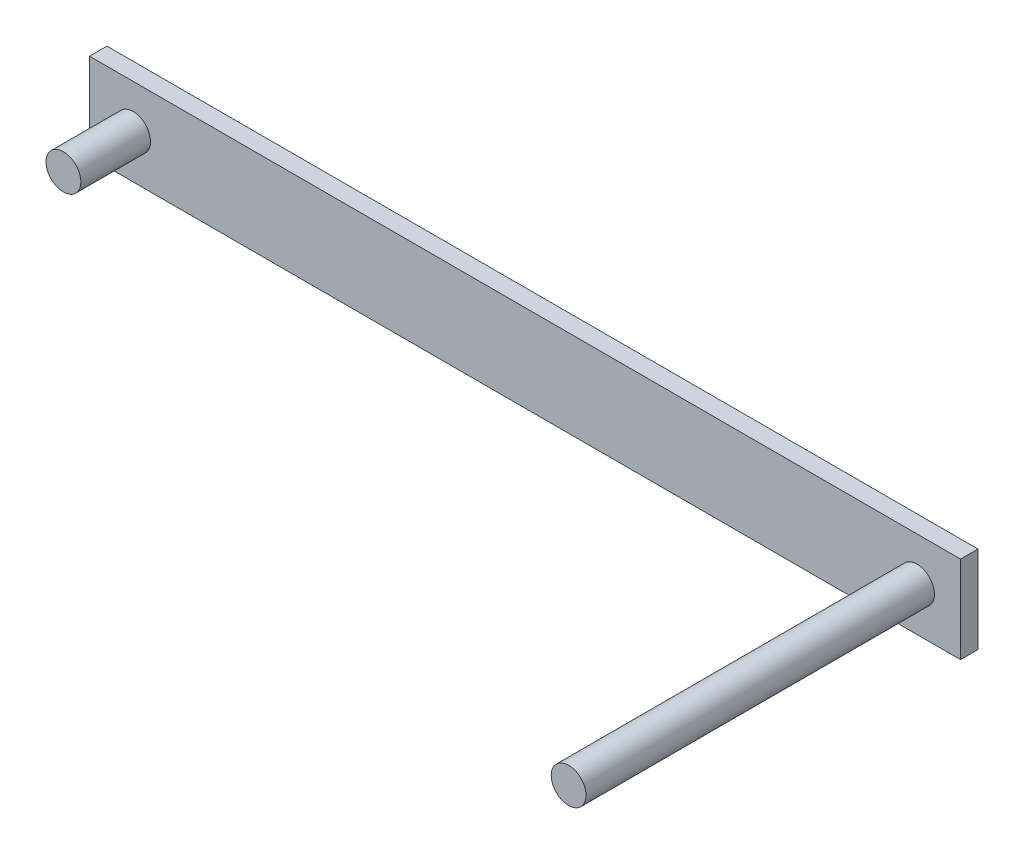
ISO-10303-21;
HEADER;
FILE_DESCRIPTION(('STEP AP214'),'2;1');
FILE_NAME('part.step','',(''),(''),'','','');
FILE_SCHEMA(('AUTOMOTIVE_DESIGN { 1 0 10303 214 1 1 1 1 }'));
ENDSEC;
DATA;
#1=APPLICATION_CONTEXT('core data for automotive mechanical design processes');
#2=APPLICATION_PROTOCOL_DEFINITION('international standard','automotive_design',2000,#1);
#3=PRODUCT_CONTEXT('',#1,'mechanical');
#4=PRODUCT('Part','Part','',(#3));
#5=PRODUCT_RELATED_PRODUCT_CATEGORY('part','',(#4));
#6=PRODUCT_DEFINITION_FORMATION('','',#4);
#7=PRODUCT_DEFINITION_CONTEXT('part definition',#1,'design');
#8=PRODUCT_DEFINITION('design','',#6,#7);
#9=PRODUCT_DEFINITION_SHAPE('','',#8);
#10=(LENGTH_UNIT() NAMED_UNIT(*) SI_UNIT(.MILLI.,.METRE.));
#11=(NAMED_UNIT(*) PLANE_ANGLE_UNIT() SI_UNIT($,.RADIAN.));
#12=(NAMED_UNIT(*) SI_UNIT($,.STERADIAN.) SOLID_ANGLE_UNIT());
#13=UNCERTAINTY_MEASURE_WITH_UNIT(LENGTH_MEASURE(1.E-05),#10,'distance_accuracy_value','');
#14=(GEOMETRIC_REPRESENTATION_CONTEXT(3) GLOBAL_UNCERTAINTY_ASSIGNED_CONTEXT((#13)) GLOBAL_UNIT_ASSIGNED_CONTEXT((#10,
#11,#12)) REPRESENTATION_CONTEXT('',''));
#15=CARTESIAN_POINT('',(0.,0.,0.));
#16=DIRECTION('',(0.,0.,1.));
#17=DIRECTION('',(1.,0.,0.));
#18=AXIS2_PLACEMENT_3D('',#15,#16,#17);
#19=CARTESIAN_POINT('',(0.,50.,10.));
#20=DIRECTION('',(0.,0.,-1.));
#21=DIRECTION('',(-1.,0.,0.));
#22=AXIS2_PLACEMENT_3D('',#19,#20,#21);
#23=PLANE('',#22);
#24=CARTESIAN_POINT('',(25.,25.,10.));
#25=DIRECTION('',(0.,0.,-1.));
#26=DIRECTION('',(-1.,0.,0.));
#27=AXIS2_PLACEMENT_3D('',#24,#25,#26);
#28=CIRCLE('',#27,10.);
#29=CARTESIAN_POINT('',(15.,25.,10.));
#30=VERTEX_POINT('',#29);
#31=EDGE_CURVE('E24',#30,#30,#28,.F.);
#32=ORIENTED_EDGE('',*,*,#31,.F.);
#33=EDGE_LOOP('',(#32));
#34=FACE_BOUND('',#33,.T.);
#35=DIRECTION('',(0.,-1.,0.));
#36=VECTOR('',#35,1.);
#37=CARTESIAN_POINT('',(0.,0.,10.));
#38=LINE('',#37,#36);
#39=CARTESIAN_POINT('',(0.,50.,10.));
#40=VERTEX_POINT('',#39);
#41=CARTESIAN_POINT('',(0.,0.,10.));
#42=VERTEX_POINT('',#41);
#43=EDGE_CURVE('E68',#40,#42,#38,.T.);
#44=ORIENTED_EDGE('',*,*,#43,.T.);
#45=DIRECTION('',(1.,0.,0.));
#46=VECTOR('',#45,1.);
#47=CARTESIAN_POINT('',(0.,0.,10.));
#48=LINE('',#47,#46);
#49=CARTESIAN_POINT('',(500.,0.,10.));
#50=VERTEX_POINT('',#49);
#51=EDGE_CURVE('E63',#42,#50,#48,.T.);
#52=ORIENTED_EDGE('',*,*,#51,.T.);
#53=DIRECTION('',(0.,1.,0.));
#54=VECTOR('',#53,1.);
#55=CARTESIAN_POINT('',(500.,0.,10.));
#56=LINE('',#55,#54);
#57=CARTESIAN_POINT('',(500.,50.,10.));
#58=VERTEX_POINT('',#57);
#59=EDGE_CURVE('E66',#50,#58,#56,.T.);
#60=ORIENTED_EDGE('',*,*,#59,.T.);
#61=DIRECTION('',(-1.,0.,0.));
#62=VECTOR('',#61,1.);
#63=CARTESIAN_POINT('',(0.,50.,10.));
#64=LINE('',#63,#62);
#65=EDGE_CURVE('E32',#58,#40,#64,.T.);
#66=ORIENTED_EDGE('',*,*,#65,.T.);
#67=EDGE_LOOP('',(#44,#52,#60,#66));
#68=FACE_BOUND('',#67,.T.);
#69=CARTESIAN_POINT('',(475.,25.,10.));
#70=DIRECTION('',(0.,0.,-1.));
#71=DIRECTION('',(-1.,0.,0.));
#72=AXIS2_PLACEMENT_3D('',#69,#70,#71);
#73=CIRCLE('',#72,10.);
#74=CARTESIAN_POINT('',(465.,25.,10.));
#75=VERTEX_POINT('',#74);
#76=EDGE_CURVE('E10',#75,#75,#73,.F.);
#77=ORIENTED_EDGE('',*,*,#76,.F.);
#78=EDGE_LOOP('',(#77));
#79=FACE_BOUND('',#78,.T.);
#80=ADVANCED_FACE('F15',(#34,#68,#79),#23,.F.);
#81=CARTESIAN_POINT('',(0.,0.,10.));
#82=DIRECTION('',(1.,0.,0.));
#83=DIRECTION('',(0.,0.,-1.));
#84=AXIS2_PLACEMENT_3D('',#81,#82,#83);
#85=PLANE('',#84);
#86=DIRECTION('',(0.,-1.,0.));
#87=VECTOR('',#86,1.);
#88=CARTESIAN_POINT('',(0.,0.,0.));
#89=LINE('',#88,#87);
#90=CARTESIAN_POINT('',(0.,50.,0.));
#91=VERTEX_POINT('',#90);
#92=CARTESIAN_POINT('',(0.,0.,0.));
#93=VERTEX_POINT('',#92);
#94=EDGE_CURVE('E83',#91,#93,#89,.T.);
#95=ORIENTED_EDGE('',*,*,#94,.T.);
#96=DIRECTION('',(0.,0.,-1.));
#97=VECTOR('',#96,1.);
#98=CARTESIAN_POINT('',(0.,0.,10.));
#99=LINE('',#98,#97);
#100=EDGE_CURVE('E74',#42,#93,#99,.T.);
#101=ORIENTED_EDGE('',*,*,#100,.F.);
#102=ORIENTED_EDGE('',*,*,#43,.F.);
#103=DIRECTION('',(0.,0.,-1.));
#104=VECTOR('',#103,1.);
#105=CARTESIAN_POINT('',(0.,50.,10.));
#106=LINE('',#105,#104);
#107=EDGE_CURVE('E79',#40,#91,#106,.T.);
#108=ORIENTED_EDGE('',*,*,#107,.T.);
#109=EDGE_LOOP('',(#95,#101,#102,#108));
#110=FACE_BOUND('',#109,.T.);
#111=ADVANCED_FACE('F17',(#110),#85,.F.);
#112=CARTESIAN_POINT('',(0.,0.,10.));
#113=DIRECTION('',(0.,1.,0.));
#114=DIRECTION('',(0.,0.,1.));
#115=AXIS2_PLACEMENT_3D('',#112,#113,#114);
#116=PLANE('',#115);
#117=DIRECTION('',(1.,0.,0.));
#118=VECTOR('',#117,1.);
#119=CARTESIAN_POINT('',(0.,0.,0.));
#120=LINE('',#119,#118);
#121=CARTESIAN_POINT('',(500.,0.,0.));
#122=VERTEX_POINT('',#121);
#123=EDGE_CURVE('E73',#93,#122,#120,.T.);
#124=ORIENTED_EDGE('',*,*,#123,.T.);
#125=DIRECTION('',(0.,0.,-1.));
#126=VECTOR('',#125,1.);
#127=CARTESIAN_POINT('',(500.,0.,10.));
#128=LINE('',#127,#126);
#129=EDGE_CURVE('E71',#50,#122,#128,.T.);
#130=ORIENTED_EDGE('',*,*,#129,.F.);
#131=ORIENTED_EDGE('',*,*,#51,.F.);
#132=ORIENTED_EDGE('',*,*,#100,.T.);
#133=EDGE_LOOP('',(#124,#130,#131,#132));
#134=FACE_BOUND('',#133,.T.);
#135=ADVANCED_FACE('F72',(#134),#116,.F.);
#136=CARTESIAN_POINT('',(500.,0.,10.));
#137=DIRECTION('',(-1.,0.,0.));
#138=DIRECTION('',(0.,0.,1.));
#139=AXIS2_PLACEMENT_3D('',#136,#137,#138);
#140=PLANE('',#139);
#141=DIRECTION('',(0.,1.,0.));
#142=VECTOR('',#141,1.);
#143=CARTESIAN_POINT('',(500.,0.,0.));
#144=LINE('',#143,#142);
#145=CARTESIAN_POINT('',(500.,50.,0.));
#146=VERTEX_POINT('',#145);
#147=EDGE_CURVE('E49',#122,#146,#144,.T.);
#148=ORIENTED_EDGE('',*,*,#147,.T.);
#149=DIRECTION('',(0.,0.,-1.));
#150=VECTOR('',#149,1.);
#151=CARTESIAN_POINT('',(500.,50.,10.));
#152=LINE('',#151,#150);
#153=EDGE_CURVE('E75',#58,#146,#152,.T.);
#154=ORIENTED_EDGE('',*,*,#153,.F.);
#155=ORIENTED_EDGE('',*,*,#59,.F.);
#156=ORIENTED_EDGE('',*,*,#129,.T.);
#157=EDGE_LOOP('',(#148,#154,#155,#156));
#158=FACE_BOUND('',#157,.T.);
#159=ADVANCED_FACE('F77',(#158),#140,.F.);
#160=CARTESIAN_POINT('',(0.,50.,10.));
#161=DIRECTION('',(0.,-1.,0.));
#162=DIRECTION('',(0.,0.,-1.));
#163=AXIS2_PLACEMENT_3D('',#160,#161,#162);
#164=PLANE('',#163);
#165=DIRECTION('',(-1.,0.,0.));
#166=VECTOR('',#165,1.);
#167=CARTESIAN_POINT('',(0.,50.,0.));
#168=LINE('',#167,#166);
#169=EDGE_CURVE('E55',#146,#91,#168,.T.);
#170=ORIENTED_EDGE('',*,*,#169,.T.);
#171=ORIENTED_EDGE('',*,*,#107,.F.);
#172=ORIENTED_EDGE('',*,*,#65,.F.);
#173=ORIENTED_EDGE('',*,*,#153,.T.);
#174=EDGE_LOOP('',(#170,#171,#172,#173));
#175=FACE_BOUND('',#174,.T.);
#176=ADVANCED_FACE('F111',(#175),#164,.F.);
#177=CARTESIAN_POINT('',(0.,50.,0.));
#178=DIRECTION('',(0.,0.,-1.));
#179=DIRECTION('',(-1.,0.,0.));
#180=AXIS2_PLACEMENT_3D('',#177,#178,#179);
#181=PLANE('',#180);
#182=ORIENTED_EDGE('',*,*,#94,.F.);
#183=ORIENTED_EDGE('',*,*,#169,.F.);
#184=ORIENTED_EDGE('',*,*,#147,.F.);
#185=ORIENTED_EDGE('',*,*,#123,.F.);
#186=EDGE_LOOP('',(#182,#183,#184,#185));
#187=FACE_BOUND('',#186,.T.);
#188=ADVANCED_FACE('F108',(#187),#181,.T.);
#189=CARTESIAN_POINT('',(25.,25.,50.));
#190=DIRECTION('',(0.,0.,-1.));
#191=DIRECTION('',(-1.,0.,0.));
#192=AXIS2_PLACEMENT_3D('',#189,#190,#191);
#193=CYLINDRICAL_SURFACE('',#192,10.);
#194=CARTESIAN_POINT('',(25.,25.,50.));
#195=DIRECTION('',(0.,0.,1.));
#196=DIRECTION('',(1.,0.,0.));
#197=AXIS2_PLACEMENT_3D('',#194,#195,#196);
#198=CIRCLE('',#197,10.);
#199=CARTESIAN_POINT('',(35.,25.,50.));
#200=VERTEX_POINT('',#199);
#201=EDGE_CURVE('E86',#200,#200,#198,.T.);
#202=ORIENTED_EDGE('',*,*,#201,.F.);
#203=EDGE_LOOP('',(#202));
#204=FACE_BOUND('',#203,.T.);
#205=ORIENTED_EDGE('',*,*,#31,.T.);
#206=EDGE_LOOP('',(#205));
#207=FACE_BOUND('',#206,.T.);
#208=ADVANCED_FACE('F95',(#204,#207),#193,.T.);
#209=CARTESIAN_POINT('',(250.,-365.989857453915,50.));
#210=DIRECTION('',(0.,0.,1.));
#211=DIRECTION('',(1.,0.,0.));
#212=AXIS2_PLACEMENT_3D('',#209,#210,#211);
#213=PLANE('',#212);
#214=ORIENTED_EDGE('',*,*,#201,.T.);
#215=EDGE_LOOP('',(#214));
#216=FACE_BOUND('',#215,.T.);
#217=ADVANCED_FACE('F148',(#216),#213,.T.);
#218=CARTESIAN_POINT('',(475.,25.,210.));
#219=DIRECTION('',(0.,0.,-1.));
#220=DIRECTION('',(-1.,0.,0.));
#221=AXIS2_PLACEMENT_3D('',#218,#219,#220);
#222=CYLINDRICAL_SURFACE('',#221,10.);
#223=CARTESIAN_POINT('',(475.,25.,210.));
#224=DIRECTION('',(0.,0.,1.));
#225=DIRECTION('',(1.,0.,0.));
#226=AXIS2_PLACEMENT_3D('',#223,#224,#225);
#227=CIRCLE('',#226,10.);
#228=CARTESIAN_POINT('',(485.,25.,210.));
#229=VERTEX_POINT('',#228);
#230=EDGE_CURVE('E196',#229,#229,#227,.T.);
#231=ORIENTED_EDGE('',*,*,#230,.F.);
#232=EDGE_LOOP('',(#231));
#233=FACE_BOUND('',#232,.T.);
#234=ORIENTED_EDGE('',*,*,#76,.T.);
#235=EDGE_LOOP('',(#234));
#236=FACE_BOUND('',#235,.T.);
#237=ADVANCED_FACE('F156',(#233,#236),#222,.T.);
#238=CARTESIAN_POINT('',(250.,-365.989857453915,210.));
#239=DIRECTION('',(0.,0.,1.));
#240=DIRECTION('',(1.,0.,0.));
#241=AXIS2_PLACEMENT_3D('',#238,#239,#240);
#242=PLANE('',#241);
#243=ORIENTED_EDGE('',*,*,#230,.T.);
#244=EDGE_LOOP('',(#243));
#245=FACE_BOUND('',#244,.T.);
#246=ADVANCED_FACE('F164',(#245),#242,.T.);
#247=CLOSED_SHELL('',(#80,#111,#135,#159,#176,#188,#208,#217,#237,#246));
#248=MANIFOLD_SOLID_BREP('B1',#247);
#249=ADVANCED_BREP_SHAPE_REPRESENTATION('',(#18,#248),#14);
#250=SHAPE_DEFINITION_REPRESENTATION(#9,#249);
ENDSEC;
END-ISO-10303-21;
